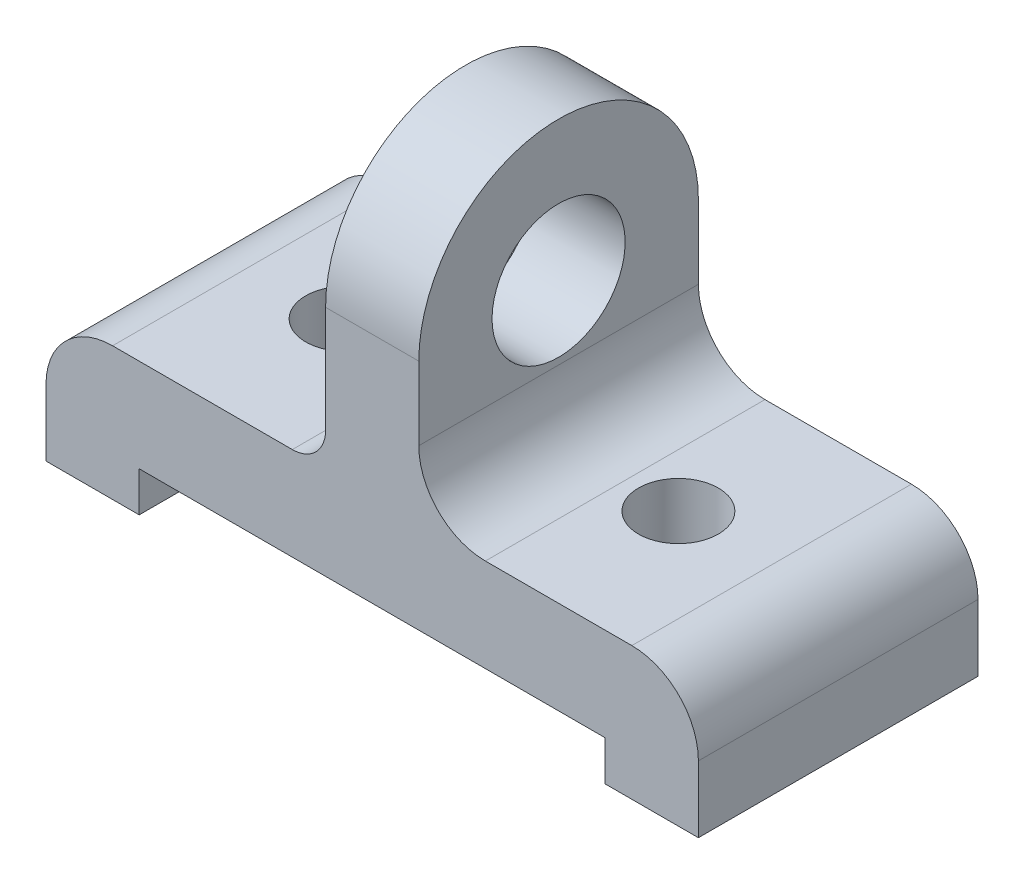
ISO-10303-21;
HEADER;
FILE_DESCRIPTION(('STEP AP214'),'2;1');
FILE_NAME('part.step','',(''),(''),'','','');
FILE_SCHEMA(('AUTOMOTIVE_DESIGN { 1 0 10303 214 1 1 1 1 }'));
ENDSEC;
DATA;
#1=APPLICATION_CONTEXT('core data for automotive mechanical design processes');
#2=APPLICATION_PROTOCOL_DEFINITION('international standard','automotive_design',2000,#1);
#3=PRODUCT_CONTEXT('',#1,'mechanical');
#4=PRODUCT('Part','Part','',(#3));
#5=PRODUCT_RELATED_PRODUCT_CATEGORY('part','',(#4));
#6=PRODUCT_DEFINITION_FORMATION('','',#4);
#7=PRODUCT_DEFINITION_CONTEXT('part definition',#1,'design');
#8=PRODUCT_DEFINITION('design','',#6,#7);
#9=PRODUCT_DEFINITION_SHAPE('','',#8);
#10=(LENGTH_UNIT() NAMED_UNIT(*) SI_UNIT(.MILLI.,.METRE.));
#11=(NAMED_UNIT(*) PLANE_ANGLE_UNIT() SI_UNIT($,.RADIAN.));
#12=(NAMED_UNIT(*) SI_UNIT($,.STERADIAN.) SOLID_ANGLE_UNIT());
#13=UNCERTAINTY_MEASURE_WITH_UNIT(LENGTH_MEASURE(1.E-05),#10,'distance_accuracy_value','');
#14=(GEOMETRIC_REPRESENTATION_CONTEXT(3) GLOBAL_UNCERTAINTY_ASSIGNED_CONTEXT((#13)) GLOBAL_UNIT_ASSIGNED_CONTEXT((#10,
#11,#12)) REPRESENTATION_CONTEXT('',''));
#15=CARTESIAN_POINT('',(0.,0.,0.));
#16=DIRECTION('',(0.,0.,1.));
#17=DIRECTION('',(1.,0.,0.));
#18=AXIS2_PLACEMENT_3D('',#15,#16,#17);
#19=CARTESIAN_POINT('',(0.,0.,0.));
#20=DIRECTION('',(0.,1.,0.));
#21=DIRECTION('',(0.,0.,1.));
#22=AXIS2_PLACEMENT_3D('',#19,#20,#21);
#23=PLANE('',#22);
#24=CARTESIAN_POINT('',(25.,0.,0.));
#25=DIRECTION('',(0.,1.,0.));
#26=DIRECTION('',(0.,0.,1.));
#27=AXIS2_PLACEMENT_3D('',#24,#25,#26);
#28=CIRCLE('',#27,6.);
#29=CARTESIAN_POINT('',(25.,0.,5.99999999999998));
#30=VERTEX_POINT('',#29);
#31=EDGE_CURVE('E242',#30,#30,#28,.T.);
#32=ORIENTED_EDGE('',*,*,#31,.F.);
#33=EDGE_LOOP('',(#32));
#34=FACE_BOUND('',#33,.T.);
#35=DIRECTION('',(-1.,0.,0.));
#36=VECTOR('',#35,1.);
#37=CARTESIAN_POINT('',(-49.,0.,-21.));
#38=LINE('',#37,#36);
#39=CARTESIAN_POINT('',(39.,0.,-21.));
#40=VERTEX_POINT('',#39);
#41=CARTESIAN_POINT('',(17.,0.,-21.));
#42=VERTEX_POINT('',#41);
#43=EDGE_CURVE('E267',#40,#42,#38,.T.);
#44=ORIENTED_EDGE('',*,*,#43,.T.);
#45=DIRECTION('',(0.,0.,1.));
#46=VECTOR('',#45,1.);
#47=CARTESIAN_POINT('',(17.,0.,0.));
#48=LINE('',#47,#46);
#49=CARTESIAN_POINT('',(17.,0.,21.));
#50=VERTEX_POINT('',#49);
#51=EDGE_CURVE('E309',#42,#50,#48,.T.);
#52=ORIENTED_EDGE('',*,*,#51,.T.);
#53=DIRECTION('',(1.,0.,0.));
#54=VECTOR('',#53,1.);
#55=CARTESIAN_POINT('',(-49.,0.,21.));
#56=LINE('',#55,#54);
#57=CARTESIAN_POINT('',(39.,0.,21.));
#58=VERTEX_POINT('',#57);
#59=EDGE_CURVE('E271',#50,#58,#56,.T.);
#60=ORIENTED_EDGE('',*,*,#59,.T.);
#61=DIRECTION('',(0.,0.,-1.));
#62=VECTOR('',#61,1.);
#63=CARTESIAN_POINT('',(39.,0.,0.));
#64=LINE('',#63,#62);
#65=EDGE_CURVE('E305',#58,#40,#64,.T.);
#66=ORIENTED_EDGE('',*,*,#65,.T.);
#67=EDGE_LOOP('',(#44,#52,#60,#66));
#68=FACE_BOUND('',#67,.T.);
#69=ADVANCED_FACE('F43',(#34,#68),#23,.T.);
#70=CARTESIAN_POINT('',(0.,-20.,0.));
#71=DIRECTION('',(0.,1.,0.));
#72=DIRECTION('',(0.,0.,1.));
#73=AXIS2_PLACEMENT_3D('',#70,#71,#72);
#74=PLANE('',#73);
#75=DIRECTION('',(0.,0.,1.));
#76=VECTOR('',#75,1.);
#77=CARTESIAN_POINT('',(35.,-20.,1.));
#78=LINE('',#77,#76);
#79=CARTESIAN_POINT('',(35.,-20.,-21.));
#80=VERTEX_POINT('',#79);
#81=CARTESIAN_POINT('',(35.,-20.,21.));
#82=VERTEX_POINT('',#81);
#83=EDGE_CURVE('E222',#80,#82,#78,.T.);
#84=ORIENTED_EDGE('',*,*,#83,.F.);
#85=DIRECTION('',(-1.,0.,0.));
#86=VECTOR('',#85,1.);
#87=CARTESIAN_POINT('',(-49.,-20.,-21.));
#88=LINE('',#87,#86);
#89=CARTESIAN_POINT('',(49.,-20.,-21.));
#90=VERTEX_POINT('',#89);
#91=EDGE_CURVE('E253',#90,#80,#88,.T.);
#92=ORIENTED_EDGE('',*,*,#91,.F.);
#93=DIRECTION('',(0.,0.,-1.));
#94=VECTOR('',#93,1.);
#95=CARTESIAN_POINT('',(49.,-20.,-21.));
#96=LINE('',#95,#94);
#97=CARTESIAN_POINT('',(49.,-20.,21.));
#98=VERTEX_POINT('',#97);
#99=EDGE_CURVE('E247',#98,#90,#96,.T.);
#100=ORIENTED_EDGE('',*,*,#99,.F.);
#101=DIRECTION('',(1.,0.,0.));
#102=VECTOR('',#101,1.);
#103=CARTESIAN_POINT('',(-49.,-20.,21.));
#104=LINE('',#103,#102);
#105=EDGE_CURVE('E261',#82,#98,#104,.T.);
#106=ORIENTED_EDGE('',*,*,#105,.F.);
#107=EDGE_LOOP('',(#84,#92,#100,#106));
#108=FACE_BOUND('',#107,.T.);
#109=ADVANCED_FACE('F375',(#108),#74,.F.);
#110=CARTESIAN_POINT('',(-35.,-20.,-21.));
#111=VERTEX_POINT('',#110);
#112=CARTESIAN_POINT('',(-49.,-20.,-21.));
#113=VERTEX_POINT('',#112);
#114=EDGE_CURVE('E251',#111,#113,#88,.T.);
#115=ORIENTED_EDGE('',*,*,#114,.F.);
#116=DIRECTION('',(0.,0.,1.));
#117=VECTOR('',#116,1.);
#118=CARTESIAN_POINT('',(-35.,-20.,1.));
#119=LINE('',#118,#117);
#120=CARTESIAN_POINT('',(-35.,-20.,21.));
#121=VERTEX_POINT('',#120);
#122=EDGE_CURVE('E226',#111,#121,#119,.T.);
#123=ORIENTED_EDGE('',*,*,#122,.T.);
#124=CARTESIAN_POINT('',(-49.,-20.,21.));
#125=VERTEX_POINT('',#124);
#126=EDGE_CURVE('E262',#125,#121,#104,.T.);
#127=ORIENTED_EDGE('',*,*,#126,.F.);
#128=DIRECTION('',(0.,0.,1.));
#129=VECTOR('',#128,1.);
#130=CARTESIAN_POINT('',(-49.,-20.,-21.));
#131=LINE('',#130,#129);
#132=EDGE_CURVE('E257',#113,#125,#131,.T.);
#133=ORIENTED_EDGE('',*,*,#132,.F.);
#134=EDGE_LOOP('',(#115,#123,#127,#133));
#135=FACE_BOUND('',#134,.T.);
#136=ADVANCED_FACE('F359',(#135),#74,.F.);
#137=CARTESIAN_POINT('',(25.,-20.,0.));
#138=DIRECTION('',(0.,1.,0.));
#139=DIRECTION('',(0.,0.,1.));
#140=AXIS2_PLACEMENT_3D('',#137,#138,#139);
#141=CYLINDRICAL_SURFACE('',#140,6.);
#142=ORIENTED_EDGE('',*,*,#31,.T.);
#143=EDGE_LOOP('',(#142));
#144=FACE_BOUND('',#143,.T.);
#145=CARTESIAN_POINT('',(25.,-14.,0.));
#146=DIRECTION('',(0.,-1.,0.));
#147=DIRECTION('',(0.,0.,-1.));
#148=AXIS2_PLACEMENT_3D('',#145,#146,#147);
#149=CIRCLE('',#148,6.);
#150=CARTESIAN_POINT('',(25.,-14.,-6.00000000000001));
#151=VERTEX_POINT('',#150);
#152=EDGE_CURVE('E225',#151,#151,#149,.F.);
#153=ORIENTED_EDGE('',*,*,#152,.F.);
#154=EDGE_LOOP('',(#153));
#155=FACE_BOUND('',#154,.T.);
#156=ADVANCED_FACE('F427',(#144,#155),#141,.F.);
#157=CARTESIAN_POINT('',(-25.,-20.,0.));
#158=DIRECTION('',(0.,1.,0.));
#159=DIRECTION('',(0.,0.,1.));
#160=AXIS2_PLACEMENT_3D('',#157,#158,#159);
#161=CYLINDRICAL_SURFACE('',#160,6.);
#162=CARTESIAN_POINT('',(-25.,0.,0.));
#163=DIRECTION('',(0.,1.,0.));
#164=DIRECTION('',(0.,0.,-1.));
#165=AXIS2_PLACEMENT_3D('',#162,#163,#164);
#166=CIRCLE('',#165,6.);
#167=CARTESIAN_POINT('',(-25.,0.,-6.00000000000002));
#168=VERTEX_POINT('',#167);
#169=EDGE_CURVE('E238',#168,#168,#166,.T.);
#170=ORIENTED_EDGE('',*,*,#169,.T.);
#171=EDGE_LOOP('',(#170));
#172=FACE_BOUND('',#171,.T.);
#173=CARTESIAN_POINT('',(-25.,-14.,0.));
#174=DIRECTION('',(0.,-1.,0.));
#175=DIRECTION('',(0.,0.,-1.));
#176=AXIS2_PLACEMENT_3D('',#173,#174,#175);
#177=CIRCLE('',#176,6.);
#178=CARTESIAN_POINT('',(-25.,-14.,-6.00000000000002));
#179=VERTEX_POINT('',#178);
#180=EDGE_CURVE('E277',#179,#179,#177,.F.);
#181=ORIENTED_EDGE('',*,*,#180,.F.);
#182=EDGE_LOOP('',(#181));
#183=FACE_BOUND('',#182,.T.);
#184=ADVANCED_FACE('F422',(#172,#183),#161,.F.);
#185=CARTESIAN_POINT('',(-49.,-20.,-21.));
#186=DIRECTION('',(0.,0.,-1.));
#187=DIRECTION('',(-1.,0.,0.));
#188=AXIS2_PLACEMENT_3D('',#185,#186,#187);
#189=PLANE('',#188);
#190=ORIENTED_EDGE('',*,*,#43,.F.);
#191=CARTESIAN_POINT('',(39.,-10.,-21.));
#192=DIRECTION('',(0.,0.,-1.));
#193=DIRECTION('',(-1.,0.,0.));
#194=AXIS2_PLACEMENT_3D('',#191,#192,#193);
#195=CIRCLE('',#194,10.);
#196=CARTESIAN_POINT('',(49.,-10.,-21.));
#197=VERTEX_POINT('',#196);
#198=EDGE_CURVE('E319',#40,#197,#195,.T.);
#199=ORIENTED_EDGE('',*,*,#198,.T.);
#200=DIRECTION('',(0.,1.,0.));
#201=VECTOR('',#200,1.);
#202=CARTESIAN_POINT('',(49.,-20.,-21.));
#203=LINE('',#202,#201);
#204=EDGE_CURVE('E266',#90,#197,#203,.T.);
#205=ORIENTED_EDGE('',*,*,#204,.F.);
#206=ORIENTED_EDGE('',*,*,#91,.T.);
#207=DIRECTION('',(0.,1.,0.));
#208=VECTOR('',#207,1.);
#209=CARTESIAN_POINT('',(35.,0.,-21.));
#210=LINE('',#209,#208);
#211=CARTESIAN_POINT('',(35.,-14.,-21.));
#212=VERTEX_POINT('',#211);
#213=EDGE_CURVE('E205',#80,#212,#210,.T.);
#214=ORIENTED_EDGE('',*,*,#213,.T.);
#215=DIRECTION('',(-1.,0.,0.));
#216=VECTOR('',#215,1.);
#217=CARTESIAN_POINT('',(0.,-14.,-21.));
#218=LINE('',#217,#216);
#219=CARTESIAN_POINT('',(-35.,-14.,-21.));
#220=VERTEX_POINT('',#219);
#221=EDGE_CURVE('E201',#212,#220,#218,.T.);
#222=ORIENTED_EDGE('',*,*,#221,.T.);
#223=DIRECTION('',(0.,-1.,0.));
#224=VECTOR('',#223,1.);
#225=CARTESIAN_POINT('',(-35.,0.,-21.));
#226=LINE('',#225,#224);
#227=EDGE_CURVE('E196',#220,#111,#226,.T.);
#228=ORIENTED_EDGE('',*,*,#227,.T.);
#229=ORIENTED_EDGE('',*,*,#114,.T.);
#230=DIRECTION('',(0.,1.,0.));
#231=VECTOR('',#230,1.);
#232=CARTESIAN_POINT('',(-49.,-20.,-21.));
#233=LINE('',#232,#231);
#234=CARTESIAN_POINT('',(-49.,-10.,-21.));
#235=VERTEX_POINT('',#234);
#236=EDGE_CURVE('E281',#113,#235,#233,.T.);
#237=ORIENTED_EDGE('',*,*,#236,.T.);
#238=CARTESIAN_POINT('',(-39.,-10.,-21.));
#239=DIRECTION('',(0.,0.,-1.));
#240=DIRECTION('',(-1.,0.,0.));
#241=AXIS2_PLACEMENT_3D('',#238,#239,#240);
#242=CIRCLE('',#241,10.);
#243=CARTESIAN_POINT('',(-39.,0.,-21.));
#244=VERTEX_POINT('',#243);
#245=EDGE_CURVE('E316',#235,#244,#242,.T.);
#246=ORIENTED_EDGE('',*,*,#245,.T.);
#247=CARTESIAN_POINT('',(-12.,0.,-21.));
#248=VERTEX_POINT('',#247);
#249=EDGE_CURVE('E246',#248,#244,#38,.T.);
#250=ORIENTED_EDGE('',*,*,#249,.F.);
#251=CARTESIAN_POINT('',(-12.,5.,-21.));
#252=DIRECTION('',(0.,0.,-1.));
#253=DIRECTION('',(-1.,0.,0.));
#254=AXIS2_PLACEMENT_3D('',#251,#252,#253);
#255=CIRCLE('',#254,5.);
#256=CARTESIAN_POINT('',(-7.,5.,-21.));
#257=VERTEX_POINT('',#256);
#258=EDGE_CURVE('E302',#248,#257,#255,.F.);
#259=ORIENTED_EDGE('',*,*,#258,.T.);
#260=DIRECTION('',(0.,-1.,0.));
#261=VECTOR('',#260,1.);
#262=CARTESIAN_POINT('',(-7.,0.,-21.));
#263=LINE('',#262,#261);
#264=CARTESIAN_POINT('',(-7.,21.,-21.));
#265=VERTEX_POINT('',#264);
#266=EDGE_CURVE('E185',#265,#257,#263,.T.);
#267=ORIENTED_EDGE('',*,*,#266,.F.);
#268=DIRECTION('',(-1.,0.,0.));
#269=VECTOR('',#268,1.);
#270=CARTESIAN_POINT('',(7.,21.,-21.));
#271=LINE('',#270,#269);
#272=CARTESIAN_POINT('',(7.,21.,-21.));
#273=VERTEX_POINT('',#272);
#274=EDGE_CURVE('E176',#273,#265,#271,.T.);
#275=ORIENTED_EDGE('',*,*,#274,.F.);
#276=DIRECTION('',(0.,-1.,0.));
#277=VECTOR('',#276,1.);
#278=CARTESIAN_POINT('',(7.,0.,-21.));
#279=LINE('',#278,#277);
#280=CARTESIAN_POINT('',(7.,10.,-21.));
#281=VERTEX_POINT('',#280);
#282=EDGE_CURVE('E168',#273,#281,#279,.T.);
#283=ORIENTED_EDGE('',*,*,#282,.T.);
#284=CARTESIAN_POINT('',(17.,10.,-21.));
#285=DIRECTION('',(0.,0.,-1.));
#286=DIRECTION('',(-1.,0.,0.));
#287=AXIS2_PLACEMENT_3D('',#284,#285,#286);
#288=CIRCLE('',#287,10.);
#289=EDGE_CURVE('E11',#281,#42,#288,.F.);
#290=ORIENTED_EDGE('',*,*,#289,.T.);
#291=EDGE_LOOP('',(#190,#199,#205,#206,#214,#222,#228,#229,#237,#246,#250,#259,#267,#275,#283,#290));
#292=FACE_BOUND('',#291,.T.);
#293=ADVANCED_FACE('F351',(#292),#189,.T.);
#294=CARTESIAN_POINT('',(-49.,-20.,21.));
#295=DIRECTION('',(0.,0.,1.));
#296=DIRECTION('',(1.,0.,0.));
#297=AXIS2_PLACEMENT_3D('',#294,#295,#296);
#298=PLANE('',#297);
#299=DIRECTION('',(0.,1.,0.));
#300=VECTOR('',#299,1.);
#301=CARTESIAN_POINT('',(49.,-20.,21.));
#302=LINE('',#301,#300);
#303=CARTESIAN_POINT('',(49.,-10.,21.));
#304=VERTEX_POINT('',#303);
#305=EDGE_CURVE('E274',#98,#304,#302,.T.);
#306=ORIENTED_EDGE('',*,*,#305,.T.);
#307=CARTESIAN_POINT('',(39.,-10.,21.));
#308=DIRECTION('',(0.,0.,1.));
#309=DIRECTION('',(1.,0.,0.));
#310=AXIS2_PLACEMENT_3D('',#307,#308,#309);
#311=CIRCLE('',#310,10.);
#312=EDGE_CURVE('E327',#304,#58,#311,.T.);
#313=ORIENTED_EDGE('',*,*,#312,.T.);
#314=ORIENTED_EDGE('',*,*,#59,.F.);
#315=CARTESIAN_POINT('',(17.,10.,21.));
#316=DIRECTION('',(0.,0.,1.));
#317=DIRECTION('',(1.,0.,0.));
#318=AXIS2_PLACEMENT_3D('',#315,#316,#317);
#319=CIRCLE('',#318,10.);
#320=CARTESIAN_POINT('',(7.,10.,21.));
#321=VERTEX_POINT('',#320);
#322=EDGE_CURVE('E52',#50,#321,#319,.F.);
#323=ORIENTED_EDGE('',*,*,#322,.T.);
#324=DIRECTION('',(0.,1.,0.));
#325=VECTOR('',#324,1.);
#326=CARTESIAN_POINT('',(7.,0.,21.));
#327=LINE('',#326,#325);
#328=CARTESIAN_POINT('',(7.,21.,21.));
#329=VERTEX_POINT('',#328);
#330=EDGE_CURVE('E155',#321,#329,#327,.T.);
#331=ORIENTED_EDGE('',*,*,#330,.T.);
#332=DIRECTION('',(-1.,0.,0.));
#333=VECTOR('',#332,1.);
#334=CARTESIAN_POINT('',(7.,21.,21.));
#335=LINE('',#334,#333);
#336=CARTESIAN_POINT('',(-7.,21.,21.));
#337=VERTEX_POINT('',#336);
#338=EDGE_CURVE('E160',#329,#337,#335,.T.);
#339=ORIENTED_EDGE('',*,*,#338,.T.);
#340=DIRECTION('',(0.,1.,0.));
#341=VECTOR('',#340,1.);
#342=CARTESIAN_POINT('',(-7.,0.,21.));
#343=LINE('',#342,#341);
#344=CARTESIAN_POINT('',(-7.,5.,21.));
#345=VERTEX_POINT('',#344);
#346=EDGE_CURVE('E189',#345,#337,#343,.T.);
#347=ORIENTED_EDGE('',*,*,#346,.F.);
#348=CARTESIAN_POINT('',(-12.,5.,21.));
#349=DIRECTION('',(0.,0.,1.));
#350=DIRECTION('',(1.,0.,0.));
#351=AXIS2_PLACEMENT_3D('',#348,#349,#350);
#352=CIRCLE('',#351,5.);
#353=CARTESIAN_POINT('',(-12.,0.,21.));
#354=VERTEX_POINT('',#353);
#355=EDGE_CURVE('E298',#345,#354,#352,.F.);
#356=ORIENTED_EDGE('',*,*,#355,.T.);
#357=CARTESIAN_POINT('',(-39.,0.,21.));
#358=VERTEX_POINT('',#357);
#359=EDGE_CURVE('E252',#358,#354,#56,.T.);
#360=ORIENTED_EDGE('',*,*,#359,.F.);
#361=CARTESIAN_POINT('',(-39.,-10.,21.));
#362=DIRECTION('',(0.,0.,1.));
#363=DIRECTION('',(1.,0.,0.));
#364=AXIS2_PLACEMENT_3D('',#361,#362,#363);
#365=CIRCLE('',#364,10.);
#366=CARTESIAN_POINT('',(-49.,-10.,21.));
#367=VERTEX_POINT('',#366);
#368=EDGE_CURVE('E59',#358,#367,#365,.T.);
#369=ORIENTED_EDGE('',*,*,#368,.T.);
#370=DIRECTION('',(0.,1.,0.));
#371=VECTOR('',#370,1.);
#372=CARTESIAN_POINT('',(-49.,-20.,21.));
#373=LINE('',#372,#371);
#374=EDGE_CURVE('E278',#125,#367,#373,.T.);
#375=ORIENTED_EDGE('',*,*,#374,.F.);
#376=ORIENTED_EDGE('',*,*,#126,.T.);
#377=DIRECTION('',(0.,1.,0.));
#378=VECTOR('',#377,1.);
#379=CARTESIAN_POINT('',(-35.,0.,21.));
#380=LINE('',#379,#378);
#381=CARTESIAN_POINT('',(-35.,-14.,21.));
#382=VERTEX_POINT('',#381);
#383=EDGE_CURVE('E217',#121,#382,#380,.T.);
#384=ORIENTED_EDGE('',*,*,#383,.T.);
#385=DIRECTION('',(1.,0.,0.));
#386=VECTOR('',#385,1.);
#387=CARTESIAN_POINT('',(0.,-14.,21.));
#388=LINE('',#387,#386);
#389=CARTESIAN_POINT('',(35.,-14.,21.));
#390=VERTEX_POINT('',#389);
#391=EDGE_CURVE('E213',#382,#390,#388,.T.);
#392=ORIENTED_EDGE('',*,*,#391,.T.);
#393=DIRECTION('',(0.,-1.,0.));
#394=VECTOR('',#393,1.);
#395=CARTESIAN_POINT('',(35.,0.,21.));
#396=LINE('',#395,#394);
#397=EDGE_CURVE('E209',#390,#82,#396,.T.);
#398=ORIENTED_EDGE('',*,*,#397,.T.);
#399=ORIENTED_EDGE('',*,*,#105,.T.);
#400=EDGE_LOOP('',(#306,#313,#314,#323,#331,#339,#347,#356,#360,#369,#375,#376,#384,#392,#398,#399));
#401=FACE_BOUND('',#400,.T.);
#402=ADVANCED_FACE('F158',(#401),#298,.T.);
#403=CARTESIAN_POINT('',(49.,-20.,-21.));
#404=DIRECTION('',(1.,0.,0.));
#405=DIRECTION('',(0.,0.,-1.));
#406=AXIS2_PLACEMENT_3D('',#403,#404,#405);
#407=PLANE('',#406);
#408=ORIENTED_EDGE('',*,*,#204,.T.);
#409=DIRECTION('',(0.,0.,-1.));
#410=VECTOR('',#409,1.);
#411=CARTESIAN_POINT('',(49.,-10.,-21.));
#412=LINE('',#411,#410);
#413=EDGE_CURVE('E322',#197,#304,#412,.F.);
#414=ORIENTED_EDGE('',*,*,#413,.T.);
#415=ORIENTED_EDGE('',*,*,#305,.F.);
#416=ORIENTED_EDGE('',*,*,#99,.T.);
#417=EDGE_LOOP('',(#408,#414,#415,#416));
#418=FACE_BOUND('',#417,.T.);
#419=ADVANCED_FACE('F378',(#418),#407,.T.);
#420=CARTESIAN_POINT('',(-49.,-20.,-21.));
#421=DIRECTION('',(-1.,0.,0.));
#422=DIRECTION('',(0.,0.,1.));
#423=AXIS2_PLACEMENT_3D('',#420,#421,#422);
#424=PLANE('',#423);
#425=ORIENTED_EDGE('',*,*,#374,.T.);
#426=DIRECTION('',(0.,0.,1.));
#427=VECTOR('',#426,1.);
#428=CARTESIAN_POINT('',(-49.,-10.,-21.));
#429=LINE('',#428,#427);
#430=EDGE_CURVE('E333',#367,#235,#429,.F.);
#431=ORIENTED_EDGE('',*,*,#430,.T.);
#432=ORIENTED_EDGE('',*,*,#236,.F.);
#433=ORIENTED_EDGE('',*,*,#132,.T.);
#434=EDGE_LOOP('',(#425,#431,#432,#433));
#435=FACE_BOUND('',#434,.T.);
#436=ADVANCED_FACE('F356',(#435),#424,.T.);
#437=ORIENTED_EDGE('',*,*,#249,.T.);
#438=DIRECTION('',(0.,0.,1.));
#439=VECTOR('',#438,1.);
#440=CARTESIAN_POINT('',(-39.,0.,0.));
#441=LINE('',#440,#439);
#442=EDGE_CURVE('E330',#244,#358,#441,.T.);
#443=ORIENTED_EDGE('',*,*,#442,.T.);
#444=ORIENTED_EDGE('',*,*,#359,.T.);
#445=DIRECTION('',(0.,0.,1.));
#446=VECTOR('',#445,1.);
#447=CARTESIAN_POINT('',(-12.,0.,-21.));
#448=LINE('',#447,#446);
#449=EDGE_CURVE('E295',#354,#248,#448,.F.);
#450=ORIENTED_EDGE('',*,*,#449,.T.);
#451=EDGE_LOOP('',(#437,#443,#444,#450));
#452=FACE_BOUND('',#451,.T.);
#453=ORIENTED_EDGE('',*,*,#169,.F.);
#454=EDGE_LOOP('',(#453));
#455=FACE_BOUND('',#454,.T.);
#456=ADVANCED_FACE('F344',(#452,#455),#23,.T.);
#457=CARTESIAN_POINT('',(0.,-14.,1.));
#458=DIRECTION('',(0.,-1.,0.));
#459=DIRECTION('',(0.,0.,-1.));
#460=AXIS2_PLACEMENT_3D('',#457,#458,#459);
#461=PLANE('',#460);
#462=ORIENTED_EDGE('',*,*,#152,.T.);
#463=EDGE_LOOP('',(#462));
#464=FACE_BOUND('',#463,.T.);
#465=ORIENTED_EDGE('',*,*,#180,.T.);
#466=EDGE_LOOP('',(#465));
#467=FACE_BOUND('',#466,.T.);
#468=DIRECTION('',(0.,0.,1.));
#469=VECTOR('',#468,1.);
#470=CARTESIAN_POINT('',(-35.,-14.,1.));
#471=LINE('',#470,#469);
#472=EDGE_CURVE('E230',#220,#382,#471,.T.);
#473=ORIENTED_EDGE('',*,*,#472,.F.);
#474=ORIENTED_EDGE('',*,*,#221,.F.);
#475=DIRECTION('',(0.,0.,1.));
#476=VECTOR('',#475,1.);
#477=CARTESIAN_POINT('',(35.,-14.,1.));
#478=LINE('',#477,#476);
#479=EDGE_CURVE('E221',#212,#390,#478,.T.);
#480=ORIENTED_EDGE('',*,*,#479,.T.);
#481=ORIENTED_EDGE('',*,*,#391,.F.);
#482=EDGE_LOOP('',(#473,#474,#480,#481));
#483=FACE_BOUND('',#482,.T.);
#484=ADVANCED_FACE('F366',(#464,#467,#483),#461,.T.);
#485=CARTESIAN_POINT('',(35.,0.,1.));
#486=DIRECTION('',(-1.,0.,0.));
#487=DIRECTION('',(0.,-1.,0.));
#488=AXIS2_PLACEMENT_3D('',#485,#486,#487);
#489=PLANE('',#488);
#490=ORIENTED_EDGE('',*,*,#397,.F.);
#491=ORIENTED_EDGE('',*,*,#479,.F.);
#492=ORIENTED_EDGE('',*,*,#213,.F.);
#493=ORIENTED_EDGE('',*,*,#83,.T.);
#494=EDGE_LOOP('',(#490,#491,#492,#493));
#495=FACE_BOUND('',#494,.T.);
#496=ADVANCED_FACE('F370',(#495),#489,.T.);
#497=CARTESIAN_POINT('',(-35.,0.,1.));
#498=DIRECTION('',(1.,0.,0.));
#499=DIRECTION('',(0.,0.,-1.));
#500=AXIS2_PLACEMENT_3D('',#497,#498,#499);
#501=PLANE('',#500);
#502=ORIENTED_EDGE('',*,*,#383,.F.);
#503=ORIENTED_EDGE('',*,*,#122,.F.);
#504=ORIENTED_EDGE('',*,*,#227,.F.);
#505=ORIENTED_EDGE('',*,*,#472,.T.);
#506=EDGE_LOOP('',(#502,#503,#504,#505));
#507=FACE_BOUND('',#506,.T.);
#508=ADVANCED_FACE('F362',(#507),#501,.T.);
#509=CARTESIAN_POINT('',(7.,21.,0.));
#510=DIRECTION('',(-1.,0.,0.));
#511=DIRECTION('',(0.,0.,1.));
#512=AXIS2_PLACEMENT_3D('',#509,#510,#511);
#513=CYLINDRICAL_SURFACE('',#512,21.);
#514=CARTESIAN_POINT('',(-7.,21.,0.));
#515=DIRECTION('',(-1.,0.,0.));
#516=DIRECTION('',(0.,0.,1.));
#517=AXIS2_PLACEMENT_3D('',#514,#515,#516);
#518=CIRCLE('',#517,21.);
#519=EDGE_CURVE('E174',#337,#265,#518,.T.);
#520=ORIENTED_EDGE('',*,*,#519,.F.);
#521=ORIENTED_EDGE('',*,*,#338,.F.);
#522=CARTESIAN_POINT('',(7.,21.,0.));
#523=DIRECTION('',(-1.,0.,0.));
#524=DIRECTION('',(0.,0.,1.));
#525=AXIS2_PLACEMENT_3D('',#522,#523,#524);
#526=CIRCLE('',#525,21.);
#527=EDGE_CURVE('E167',#329,#273,#526,.T.);
#528=ORIENTED_EDGE('',*,*,#527,.T.);
#529=ORIENTED_EDGE('',*,*,#274,.T.);
#530=EDGE_LOOP('',(#520,#521,#528,#529));
#531=FACE_BOUND('',#530,.T.);
#532=ADVANCED_FACE('F172',(#531),#513,.T.);
#533=CARTESIAN_POINT('',(7.,21.,0.));
#534=DIRECTION('',(-1.,0.,0.));
#535=DIRECTION('',(0.,0.,1.));
#536=AXIS2_PLACEMENT_3D('',#533,#534,#535);
#537=PLANE('',#536);
#538=CARTESIAN_POINT('',(7.,21.,0.));
#539=DIRECTION('',(-1.,0.,0.));
#540=DIRECTION('',(0.,0.,1.));
#541=AXIS2_PLACEMENT_3D('',#538,#539,#540);
#542=CIRCLE('',#541,10.);
#543=CARTESIAN_POINT('',(7.,21.,9.99999999999999));
#544=VERTEX_POINT('',#543);
#545=EDGE_CURVE('E190',#544,#544,#542,.T.);
#546=ORIENTED_EDGE('',*,*,#545,.T.);
#547=EDGE_LOOP('',(#546));
#548=FACE_BOUND('',#547,.T.);
#549=ORIENTED_EDGE('',*,*,#330,.F.);
#550=DIRECTION('',(0.,0.,1.));
#551=VECTOR('',#550,1.);
#552=CARTESIAN_POINT('',(7.,10.,0.));
#553=LINE('',#552,#551);
#554=EDGE_CURVE('E313',#321,#281,#553,.F.);
#555=ORIENTED_EDGE('',*,*,#554,.T.);
#556=ORIENTED_EDGE('',*,*,#282,.F.);
#557=ORIENTED_EDGE('',*,*,#527,.F.);
#558=EDGE_LOOP('',(#549,#555,#556,#557));
#559=FACE_BOUND('',#558,.T.);
#560=ADVANCED_FACE('F179',(#548,#559),#537,.F.);
#561=CARTESIAN_POINT('',(-7.,21.,0.));
#562=DIRECTION('',(-1.,0.,0.));
#563=DIRECTION('',(0.,0.,1.));
#564=AXIS2_PLACEMENT_3D('',#561,#562,#563);
#565=PLANE('',#564);
#566=CARTESIAN_POINT('',(-7.,21.,0.));
#567=DIRECTION('',(-1.,0.,0.));
#568=DIRECTION('',(0.,0.,1.));
#569=AXIS2_PLACEMENT_3D('',#566,#567,#568);
#570=CIRCLE('',#569,10.);
#571=CARTESIAN_POINT('',(-7.,21.,9.99999999999999));
#572=VERTEX_POINT('',#571);
#573=EDGE_CURVE('E459',#572,#572,#570,.T.);
#574=ORIENTED_EDGE('',*,*,#573,.F.);
#575=EDGE_LOOP('',(#574));
#576=FACE_BOUND('',#575,.T.);
#577=ORIENTED_EDGE('',*,*,#266,.T.);
#578=DIRECTION('',(0.,0.,1.));
#579=VECTOR('',#578,1.);
#580=CARTESIAN_POINT('',(-7.,5.,21.));
#581=LINE('',#580,#579);
#582=EDGE_CURVE('E291',#257,#345,#581,.T.);
#583=ORIENTED_EDGE('',*,*,#582,.T.);
#584=ORIENTED_EDGE('',*,*,#346,.T.);
#585=ORIENTED_EDGE('',*,*,#519,.T.);
#586=EDGE_LOOP('',(#577,#583,#584,#585));
#587=FACE_BOUND('',#586,.T.);
#588=ADVANCED_FACE('F443',(#576,#587),#565,.T.);
#589=CARTESIAN_POINT('',(7.,21.,0.));
#590=DIRECTION('',(-1.,0.,0.));
#591=DIRECTION('',(0.,0.,1.));
#592=AXIS2_PLACEMENT_3D('',#589,#590,#591);
#593=CYLINDRICAL_SURFACE('',#592,10.);
#594=ORIENTED_EDGE('',*,*,#545,.F.);
#595=EDGE_LOOP('',(#594));
#596=FACE_BOUND('',#595,.T.);
#597=ORIENTED_EDGE('',*,*,#573,.T.);
#598=EDGE_LOOP('',(#597));
#599=FACE_BOUND('',#598,.T.);
#600=ADVANCED_FACE('F396',(#596,#599),#593,.F.);
#601=CARTESIAN_POINT('',(-12.,5.,0.));
#602=DIRECTION('',(0.,0.,-1.));
#603=DIRECTION('',(-1.,0.,0.));
#604=AXIS2_PLACEMENT_3D('',#601,#602,#603);
#605=CYLINDRICAL_SURFACE('',#604,5.);
#606=ORIENTED_EDGE('',*,*,#258,.F.);
#607=ORIENTED_EDGE('',*,*,#449,.F.);
#608=ORIENTED_EDGE('',*,*,#355,.F.);
#609=ORIENTED_EDGE('',*,*,#582,.F.);
#610=EDGE_LOOP('',(#606,#607,#608,#609));
#611=FACE_BOUND('',#610,.T.);
#612=ADVANCED_FACE('F390',(#611),#605,.F.);
#613=CARTESIAN_POINT('',(17.,10.,0.));
#614=DIRECTION('',(0.,0.,1.));
#615=DIRECTION('',(1.,0.,0.));
#616=AXIS2_PLACEMENT_3D('',#613,#614,#615);
#617=CYLINDRICAL_SURFACE('',#616,10.);
#618=ORIENTED_EDGE('',*,*,#289,.F.);
#619=ORIENTED_EDGE('',*,*,#554,.F.);
#620=ORIENTED_EDGE('',*,*,#322,.F.);
#621=ORIENTED_EDGE('',*,*,#51,.F.);
#622=EDGE_LOOP('',(#618,#619,#620,#621));
#623=FACE_BOUND('',#622,.T.);
#624=ADVANCED_FACE('F388',(#623),#617,.F.);
#625=CARTESIAN_POINT('',(39.,-10.,0.));
#626=DIRECTION('',(0.,0.,-1.));
#627=DIRECTION('',(-1.,0.,0.));
#628=AXIS2_PLACEMENT_3D('',#625,#626,#627);
#629=CYLINDRICAL_SURFACE('',#628,10.);
#630=ORIENTED_EDGE('',*,*,#312,.F.);
#631=ORIENTED_EDGE('',*,*,#413,.F.);
#632=ORIENTED_EDGE('',*,*,#198,.F.);
#633=ORIENTED_EDGE('',*,*,#65,.F.);
#634=EDGE_LOOP('',(#630,#631,#632,#633));
#635=FACE_BOUND('',#634,.T.);
#636=ADVANCED_FACE('F383',(#635),#629,.T.);
#637=CARTESIAN_POINT('',(-39.,-10.,0.));
#638=DIRECTION('',(0.,0.,1.));
#639=DIRECTION('',(1.,0.,0.));
#640=AXIS2_PLACEMENT_3D('',#637,#638,#639);
#641=CYLINDRICAL_SURFACE('',#640,10.);
#642=ORIENTED_EDGE('',*,*,#245,.F.);
#643=ORIENTED_EDGE('',*,*,#430,.F.);
#644=ORIENTED_EDGE('',*,*,#368,.F.);
#645=ORIENTED_EDGE('',*,*,#442,.F.);
#646=EDGE_LOOP('',(#642,#643,#644,#645));
#647=FACE_BOUND('',#646,.T.);
#648=ADVANCED_FACE('F45',(#647),#641,.T.);
#649=CLOSED_SHELL('',(#69,#109,#136,#156,#184,#293,#402,#419,#436,#456,#484,#496,#508,#532,#560,
#588,#600,#612,#624,#636,#648));
#650=MANIFOLD_SOLID_BREP('B2',#649);
#651=ADVANCED_BREP_SHAPE_REPRESENTATION('',(#18,#650),#14);
#652=SHAPE_DEFINITION_REPRESENTATION(#9,#651);
ENDSEC;
END-ISO-10303-21;
